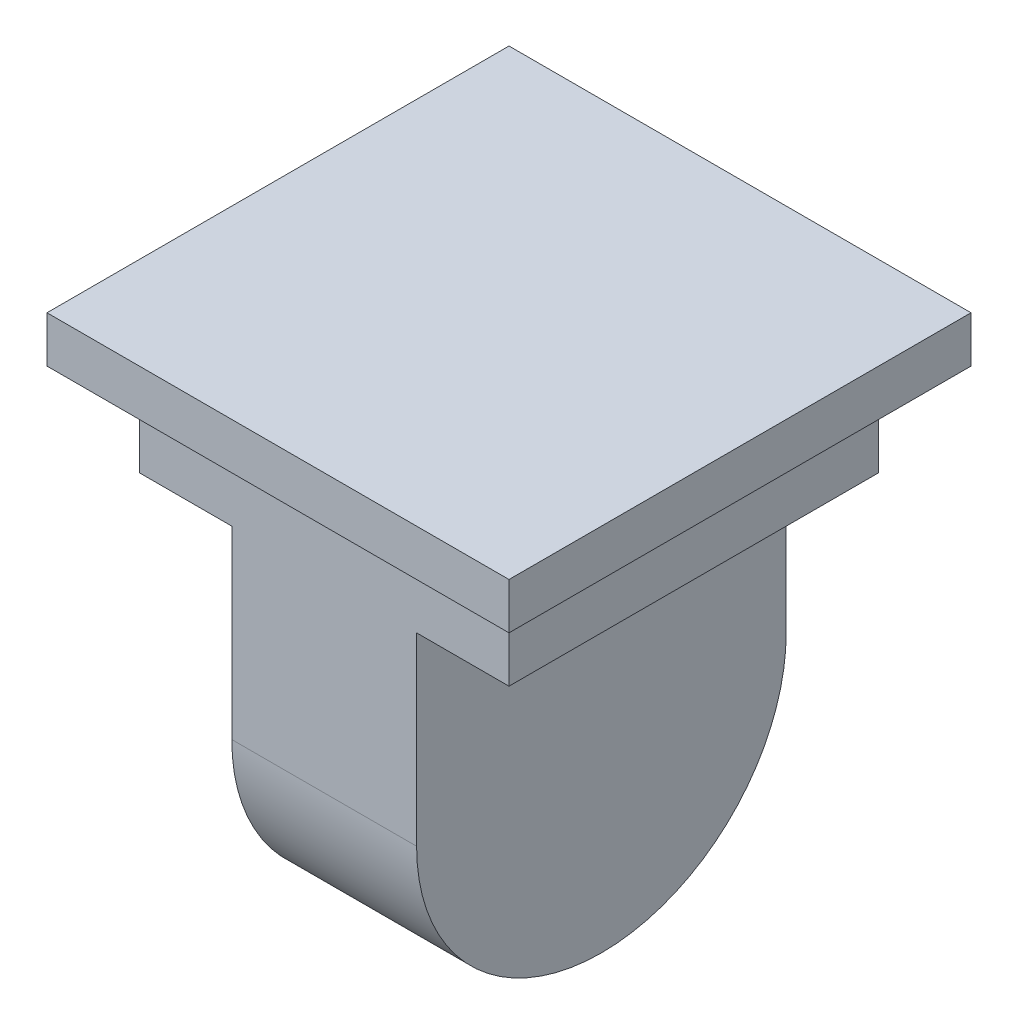
ISO-10303-21;
HEADER;
FILE_DESCRIPTION(('STEP AP214'),'2;1');
FILE_NAME('part.step','',(''),(''),'','','');
FILE_SCHEMA(('AUTOMOTIVE_DESIGN { 1 0 10303 214 1 1 1 1 }'));
ENDSEC;
DATA;
#1=APPLICATION_CONTEXT('core data for automotive mechanical design processes');
#2=APPLICATION_PROTOCOL_DEFINITION('international standard','automotive_design',2000,#1);
#3=PRODUCT_CONTEXT('',#1,'mechanical');
#4=PRODUCT('Part','Part','',(#3));
#5=PRODUCT_RELATED_PRODUCT_CATEGORY('part','',(#4));
#6=PRODUCT_DEFINITION_FORMATION('','',#4);
#7=PRODUCT_DEFINITION_CONTEXT('part definition',#1,'design');
#8=PRODUCT_DEFINITION('design','',#6,#7);
#9=PRODUCT_DEFINITION_SHAPE('','',#8);
#10=(LENGTH_UNIT() NAMED_UNIT(*) SI_UNIT(.MILLI.,.METRE.));
#11=(NAMED_UNIT(*) PLANE_ANGLE_UNIT() SI_UNIT($,.RADIAN.));
#12=(NAMED_UNIT(*) SI_UNIT($,.STERADIAN.) SOLID_ANGLE_UNIT());
#13=UNCERTAINTY_MEASURE_WITH_UNIT(LENGTH_MEASURE(1.E-05),#10,'distance_accuracy_value','');
#14=(GEOMETRIC_REPRESENTATION_CONTEXT(3) GLOBAL_UNCERTAINTY_ASSIGNED_CONTEXT((#13)) GLOBAL_UNIT_ASSIGNED_CONTEXT((#10,
#11,#12)) REPRESENTATION_CONTEXT('',''));
#15=CARTESIAN_POINT('',(0.,0.,0.));
#16=DIRECTION('',(0.,0.,1.));
#17=DIRECTION('',(1.,0.,0.));
#18=AXIS2_PLACEMENT_3D('',#15,#16,#17);
#19=CARTESIAN_POINT('',(-32.,8.,0.));
#20=DIRECTION('',(1.,0.,0.));
#21=DIRECTION('',(0.,0.,-1.));
#22=AXIS2_PLACEMENT_3D('',#19,#20,#21);
#23=CYLINDRICAL_SURFACE('',#22,8.);
#24=CARTESIAN_POINT('',(4.,8.,0.));
#25=DIRECTION('',(1.,0.,0.));
#26=DIRECTION('',(0.,0.,-1.));
#27=AXIS2_PLACEMENT_3D('',#24,#25,#26);
#28=CIRCLE('',#27,8.);
#29=CARTESIAN_POINT('',(4.,8.,8.));
#30=VERTEX_POINT('',#29);
#31=CARTESIAN_POINT('',(4.,8.,-8.));
#32=VERTEX_POINT('',#31);
#33=EDGE_CURVE('E51',#30,#32,#28,.T.);
#34=ORIENTED_EDGE('',*,*,#33,.F.);
#35=DIRECTION('',(1.,0.,0.));
#36=VECTOR('',#35,1.);
#37=CARTESIAN_POINT('',(-32.,8.,8.00000000000001));
#38=LINE('',#37,#36);
#39=CARTESIAN_POINT('',(-4.,8.,8.));
#40=VERTEX_POINT('',#39);
#41=EDGE_CURVE('E186',#40,#30,#38,.T.);
#42=ORIENTED_EDGE('',*,*,#41,.F.);
#43=CARTESIAN_POINT('',(-4.,8.,0.));
#44=DIRECTION('',(-1.,0.,0.));
#45=DIRECTION('',(0.,0.,1.));
#46=AXIS2_PLACEMENT_3D('',#43,#44,#45);
#47=CIRCLE('',#46,8.);
#48=CARTESIAN_POINT('',(-4.,8.,-8.));
#49=VERTEX_POINT('',#48);
#50=EDGE_CURVE('E173',#49,#40,#47,.T.);
#51=ORIENTED_EDGE('',*,*,#50,.F.);
#52=DIRECTION('',(1.,0.,0.));
#53=VECTOR('',#52,1.);
#54=CARTESIAN_POINT('',(-32.,8.,-7.99999999999999));
#55=LINE('',#54,#53);
#56=EDGE_CURVE('E188',#49,#32,#55,.T.);
#57=ORIENTED_EDGE('',*,*,#56,.T.);
#58=EDGE_LOOP('',(#34,#42,#51,#57));
#59=FACE_BOUND('',#58,.T.);
#60=ADVANCED_FACE('F36',(#59),#23,.T.);
#61=CARTESIAN_POINT('',(-8.,20.,8.));
#62=DIRECTION('',(0.,0.,-1.));
#63=DIRECTION('',(-1.,0.,0.));
#64=AXIS2_PLACEMENT_3D('',#61,#62,#63);
#65=PLANE('',#64);
#66=DIRECTION('',(0.,-1.,0.));
#67=VECTOR('',#66,1.);
#68=CARTESIAN_POINT('',(4.,8.,8.));
#69=LINE('',#68,#67);
#70=CARTESIAN_POINT('',(4.,16.,8.));
#71=VERTEX_POINT('',#70);
#72=EDGE_CURVE('E165',#71,#30,#69,.T.);
#73=ORIENTED_EDGE('',*,*,#72,.F.);
#74=DIRECTION('',(1.,0.,0.));
#75=VECTOR('',#74,1.);
#76=CARTESIAN_POINT('',(4.,16.,8.));
#77=LINE('',#76,#75);
#78=CARTESIAN_POINT('',(8.,16.,8.));
#79=VERTEX_POINT('',#78);
#80=EDGE_CURVE('E168',#71,#79,#77,.T.);
#81=ORIENTED_EDGE('',*,*,#80,.T.);
#82=DIRECTION('',(0.,-1.,0.));
#83=VECTOR('',#82,1.);
#84=CARTESIAN_POINT('',(8.,20.,8.));
#85=LINE('',#84,#83);
#86=CARTESIAN_POINT('',(8.,20.,8.));
#87=VERTEX_POINT('',#86);
#88=EDGE_CURVE('E44',#87,#79,#85,.T.);
#89=ORIENTED_EDGE('',*,*,#88,.F.);
#90=DIRECTION('',(1.,0.,0.));
#91=VECTOR('',#90,1.);
#92=CARTESIAN_POINT('',(-8.,20.,8.));
#93=LINE('',#92,#91);
#94=CARTESIAN_POINT('',(-8.,20.,8.));
#95=VERTEX_POINT('',#94);
#96=EDGE_CURVE('E196',#95,#87,#93,.T.);
#97=ORIENTED_EDGE('',*,*,#96,.F.);
#98=DIRECTION('',(0.,-1.,0.));
#99=VECTOR('',#98,1.);
#100=CARTESIAN_POINT('',(-8.,20.,8.));
#101=LINE('',#100,#99);
#102=CARTESIAN_POINT('',(-8.,16.,8.));
#103=VERTEX_POINT('',#102);
#104=EDGE_CURVE('E11',#95,#103,#101,.T.);
#105=ORIENTED_EDGE('',*,*,#104,.T.);
#106=DIRECTION('',(-1.,0.,0.));
#107=VECTOR('',#106,1.);
#108=CARTESIAN_POINT('',(-4.,16.,8.));
#109=LINE('',#108,#107);
#110=CARTESIAN_POINT('',(-4.,16.,8.));
#111=VERTEX_POINT('',#110);
#112=EDGE_CURVE('E181',#111,#103,#109,.T.);
#113=ORIENTED_EDGE('',*,*,#112,.F.);
#114=DIRECTION('',(0.,1.,0.));
#115=VECTOR('',#114,1.);
#116=CARTESIAN_POINT('',(-4.,8.,8.));
#117=LINE('',#116,#115);
#118=EDGE_CURVE('E175',#40,#111,#117,.T.);
#119=ORIENTED_EDGE('',*,*,#118,.F.);
#120=ORIENTED_EDGE('',*,*,#41,.T.);
#121=EDGE_LOOP('',(#73,#81,#89,#97,#105,#113,#119,#120));
#122=FACE_BOUND('',#121,.T.);
#123=ADVANCED_FACE('F217',(#122),#65,.F.);
#124=CARTESIAN_POINT('',(-8.,20.,-8.));
#125=DIRECTION('',(1.,0.,0.));
#126=DIRECTION('',(0.,0.,-1.));
#127=AXIS2_PLACEMENT_3D('',#124,#125,#126);
#128=PLANE('',#127);
#129=DIRECTION('',(0.,-1.,0.));
#130=VECTOR('',#129,1.);
#131=CARTESIAN_POINT('',(-8.,20.,-8.));
#132=LINE('',#131,#130);
#133=CARTESIAN_POINT('',(-8.,20.,-8.));
#134=VERTEX_POINT('',#133);
#135=CARTESIAN_POINT('',(-8.,16.,-8.));
#136=VERTEX_POINT('',#135);
#137=EDGE_CURVE('E205',#134,#136,#132,.T.);
#138=ORIENTED_EDGE('',*,*,#137,.T.);
#139=DIRECTION('',(0.,0.,-1.));
#140=VECTOR('',#139,1.);
#141=CARTESIAN_POINT('',(-8.,16.,-8.));
#142=LINE('',#141,#140);
#143=EDGE_CURVE('E171',#103,#136,#142,.T.);
#144=ORIENTED_EDGE('',*,*,#143,.F.);
#145=ORIENTED_EDGE('',*,*,#104,.F.);
#146=DIRECTION('',(0.,0.,1.));
#147=VECTOR('',#146,1.);
#148=CARTESIAN_POINT('',(-8.,20.,-8.));
#149=LINE('',#148,#147);
#150=EDGE_CURVE('E191',#134,#95,#149,.T.);
#151=ORIENTED_EDGE('',*,*,#150,.F.);
#152=EDGE_LOOP('',(#138,#144,#145,#151));
#153=FACE_BOUND('',#152,.T.);
#154=ADVANCED_FACE('F38',(#153),#128,.F.);
#155=CARTESIAN_POINT('',(8.,20.,-8.));
#156=DIRECTION('',(-1.,0.,0.));
#157=DIRECTION('',(0.,0.,1.));
#158=AXIS2_PLACEMENT_3D('',#155,#156,#157);
#159=PLANE('',#158);
#160=ORIENTED_EDGE('',*,*,#88,.T.);
#161=DIRECTION('',(0.,0.,1.));
#162=VECTOR('',#161,1.);
#163=CARTESIAN_POINT('',(8.,16.,8.));
#164=LINE('',#163,#162);
#165=CARTESIAN_POINT('',(8.,16.,-8.00000000000001));
#166=VERTEX_POINT('',#165);
#167=EDGE_CURVE('E152',#166,#79,#164,.T.);
#168=ORIENTED_EDGE('',*,*,#167,.F.);
#169=DIRECTION('',(0.,-1.,0.));
#170=VECTOR('',#169,1.);
#171=CARTESIAN_POINT('',(8.,20.,-8.));
#172=LINE('',#171,#170);
#173=CARTESIAN_POINT('',(8.,20.,-8.));
#174=VERTEX_POINT('',#173);
#175=EDGE_CURVE('E208',#174,#166,#172,.T.);
#176=ORIENTED_EDGE('',*,*,#175,.F.);
#177=DIRECTION('',(0.,0.,-1.));
#178=VECTOR('',#177,1.);
#179=CARTESIAN_POINT('',(8.,20.,-8.));
#180=LINE('',#179,#178);
#181=EDGE_CURVE('E199',#87,#174,#180,.T.);
#182=ORIENTED_EDGE('',*,*,#181,.F.);
#183=EDGE_LOOP('',(#160,#168,#176,#182));
#184=FACE_BOUND('',#183,.T.);
#185=ADVANCED_FACE('F214',(#184),#159,.F.);
#186=CARTESIAN_POINT('',(-8.,20.,-8.));
#187=DIRECTION('',(0.,0.,1.));
#188=DIRECTION('',(1.,0.,0.));
#189=AXIS2_PLACEMENT_3D('',#186,#187,#188);
#190=PLANE('',#189);
#191=ORIENTED_EDGE('',*,*,#175,.T.);
#192=DIRECTION('',(1.,0.,0.));
#193=VECTOR('',#192,1.);
#194=CARTESIAN_POINT('',(4.,16.,-8.00000000000001));
#195=LINE('',#194,#193);
#196=CARTESIAN_POINT('',(4.,16.,-8.00000000000001));
#197=VERTEX_POINT('',#196);
#198=EDGE_CURVE('E166',#197,#166,#195,.T.);
#199=ORIENTED_EDGE('',*,*,#198,.F.);
#200=DIRECTION('',(0.,1.,0.));
#201=VECTOR('',#200,1.);
#202=CARTESIAN_POINT('',(4.,8.,-8.00000000000001));
#203=LINE('',#202,#201);
#204=EDGE_CURVE('E160',#32,#197,#203,.T.);
#205=ORIENTED_EDGE('',*,*,#204,.F.);
#206=ORIENTED_EDGE('',*,*,#56,.F.);
#207=DIRECTION('',(0.,-1.,0.));
#208=VECTOR('',#207,1.);
#209=CARTESIAN_POINT('',(-4.,8.,-8.));
#210=LINE('',#209,#208);
#211=CARTESIAN_POINT('',(-4.,16.,-8.));
#212=VERTEX_POINT('',#211);
#213=EDGE_CURVE('E59',#212,#49,#210,.T.);
#214=ORIENTED_EDGE('',*,*,#213,.F.);
#215=DIRECTION('',(-1.,0.,0.));
#216=VECTOR('',#215,1.);
#217=CARTESIAN_POINT('',(-4.,16.,-8.));
#218=LINE('',#217,#216);
#219=EDGE_CURVE('E183',#212,#136,#218,.T.);
#220=ORIENTED_EDGE('',*,*,#219,.T.);
#221=ORIENTED_EDGE('',*,*,#137,.F.);
#222=DIRECTION('',(-1.,0.,0.));
#223=VECTOR('',#222,1.);
#224=CARTESIAN_POINT('',(-8.,20.,-8.));
#225=LINE('',#224,#223);
#226=EDGE_CURVE('E202',#174,#134,#225,.T.);
#227=ORIENTED_EDGE('',*,*,#226,.F.);
#228=EDGE_LOOP('',(#191,#199,#205,#206,#214,#220,#221,#227));
#229=FACE_BOUND('',#228,.T.);
#230=ADVANCED_FACE('F225',(#229),#190,.F.);
#231=CARTESIAN_POINT('',(-4.,16.,-8.));
#232=DIRECTION('',(0.,1.,0.));
#233=DIRECTION('',(0.,0.,1.));
#234=AXIS2_PLACEMENT_3D('',#231,#232,#233);
#235=PLANE('',#234);
#236=ORIENTED_EDGE('',*,*,#143,.T.);
#237=ORIENTED_EDGE('',*,*,#219,.F.);
#238=DIRECTION('',(0.,0.,-1.));
#239=VECTOR('',#238,1.);
#240=CARTESIAN_POINT('',(-4.,16.,-8.));
#241=LINE('',#240,#239);
#242=EDGE_CURVE('E178',#111,#212,#241,.T.);
#243=ORIENTED_EDGE('',*,*,#242,.F.);
#244=ORIENTED_EDGE('',*,*,#112,.T.);
#245=EDGE_LOOP('',(#236,#237,#243,#244));
#246=FACE_BOUND('',#245,.T.);
#247=ADVANCED_FACE('F236',(#246),#235,.F.);
#248=CARTESIAN_POINT('',(-4.,8.,0.));
#249=DIRECTION('',(-1.,0.,0.));
#250=DIRECTION('',(0.,0.,1.));
#251=AXIS2_PLACEMENT_3D('',#248,#249,#250);
#252=PLANE('',#251);
#253=ORIENTED_EDGE('',*,*,#50,.T.);
#254=ORIENTED_EDGE('',*,*,#118,.T.);
#255=ORIENTED_EDGE('',*,*,#242,.T.);
#256=ORIENTED_EDGE('',*,*,#213,.T.);
#257=EDGE_LOOP('',(#253,#254,#255,#256));
#258=FACE_BOUND('',#257,.T.);
#259=ADVANCED_FACE('F237',(#258),#252,.T.);
#260=CARTESIAN_POINT('',(4.,16.,8.));
#261=DIRECTION('',(0.,1.,0.));
#262=DIRECTION('',(0.,0.,1.));
#263=AXIS2_PLACEMENT_3D('',#260,#261,#262);
#264=PLANE('',#263);
#265=ORIENTED_EDGE('',*,*,#167,.T.);
#266=ORIENTED_EDGE('',*,*,#80,.F.);
#267=DIRECTION('',(0.,0.,1.));
#268=VECTOR('',#267,1.);
#269=CARTESIAN_POINT('',(4.,16.,8.));
#270=LINE('',#269,#268);
#271=EDGE_CURVE('E162',#197,#71,#270,.T.);
#272=ORIENTED_EDGE('',*,*,#271,.F.);
#273=ORIENTED_EDGE('',*,*,#198,.T.);
#274=EDGE_LOOP('',(#265,#266,#272,#273));
#275=FACE_BOUND('',#274,.T.);
#276=ADVANCED_FACE('F220',(#275),#264,.F.);
#277=CARTESIAN_POINT('',(4.,8.,0.));
#278=DIRECTION('',(1.,0.,0.));
#279=DIRECTION('',(0.,0.,-1.));
#280=AXIS2_PLACEMENT_3D('',#277,#278,#279);
#281=PLANE('',#280);
#282=ORIENTED_EDGE('',*,*,#33,.T.);
#283=ORIENTED_EDGE('',*,*,#204,.T.);
#284=ORIENTED_EDGE('',*,*,#271,.T.);
#285=ORIENTED_EDGE('',*,*,#72,.T.);
#286=EDGE_LOOP('',(#282,#283,#284,#285));
#287=FACE_BOUND('',#286,.T.);
#288=ADVANCED_FACE('F221',(#287),#281,.T.);
#289=CARTESIAN_POINT('',(0.,20.,0.));
#290=DIRECTION('',(0.,1.,0.));
#291=DIRECTION('',(0.,0.,1.));
#292=AXIS2_PLACEMENT_3D('',#289,#290,#291);
#293=PLANE('',#292);
#294=DIRECTION('',(0.,0.,1.));
#295=VECTOR('',#294,1.);
#296=CARTESIAN_POINT('',(-10.,20.,-10.));
#297=LINE('',#296,#295);
#298=CARTESIAN_POINT('',(-10.,20.,-10.));
#299=VERTEX_POINT('',#298);
#300=CARTESIAN_POINT('',(-10.,20.,10.));
#301=VERTEX_POINT('',#300);
#302=EDGE_CURVE('E151',#299,#301,#297,.T.);
#303=ORIENTED_EDGE('',*,*,#302,.F.);
#304=DIRECTION('',(-1.,0.,0.));
#305=VECTOR('',#304,1.);
#306=CARTESIAN_POINT('',(-10.,20.,-10.));
#307=LINE('',#306,#305);
#308=CARTESIAN_POINT('',(10.,20.,-10.));
#309=VERTEX_POINT('',#308);
#310=EDGE_CURVE('E147',#309,#299,#307,.T.);
#311=ORIENTED_EDGE('',*,*,#310,.F.);
#312=DIRECTION('',(0.,0.,-1.));
#313=VECTOR('',#312,1.);
#314=CARTESIAN_POINT('',(10.,20.,-10.));
#315=LINE('',#314,#313);
#316=CARTESIAN_POINT('',(10.,20.,10.));
#317=VERTEX_POINT('',#316);
#318=EDGE_CURVE('E363',#317,#309,#315,.T.);
#319=ORIENTED_EDGE('',*,*,#318,.F.);
#320=DIRECTION('',(1.,0.,0.));
#321=VECTOR('',#320,1.);
#322=CARTESIAN_POINT('',(-10.,20.,10.));
#323=LINE('',#322,#321);
#324=EDGE_CURVE('E366',#301,#317,#323,.T.);
#325=ORIENTED_EDGE('',*,*,#324,.F.);
#326=EDGE_LOOP('',(#303,#311,#319,#325));
#327=FACE_BOUND('',#326,.T.);
#328=ORIENTED_EDGE('',*,*,#226,.T.);
#329=ORIENTED_EDGE('',*,*,#150,.T.);
#330=ORIENTED_EDGE('',*,*,#96,.T.);
#331=ORIENTED_EDGE('',*,*,#181,.T.);
#332=EDGE_LOOP('',(#328,#329,#330,#331));
#333=FACE_BOUND('',#332,.T.);
#334=ADVANCED_FACE('F229',(#327,#333),#293,.F.);
#335=CARTESIAN_POINT('',(-10.,22.,-10.));
#336=DIRECTION('',(1.,0.,0.));
#337=DIRECTION('',(0.,0.,-1.));
#338=AXIS2_PLACEMENT_3D('',#335,#336,#337);
#339=PLANE('',#338);
#340=ORIENTED_EDGE('',*,*,#302,.T.);
#341=DIRECTION('',(0.,-1.,0.));
#342=VECTOR('',#341,1.);
#343=CARTESIAN_POINT('',(-10.,22.,10.));
#344=LINE('',#343,#342);
#345=CARTESIAN_POINT('',(-10.,22.,10.));
#346=VERTEX_POINT('',#345);
#347=EDGE_CURVE('E131',#346,#301,#344,.T.);
#348=ORIENTED_EDGE('',*,*,#347,.F.);
#349=DIRECTION('',(0.,0.,1.));
#350=VECTOR('',#349,1.);
#351=CARTESIAN_POINT('',(-10.,22.,-10.));
#352=LINE('',#351,#350);
#353=CARTESIAN_POINT('',(-10.,22.,-10.));
#354=VERTEX_POINT('',#353);
#355=EDGE_CURVE('E138',#354,#346,#352,.T.);
#356=ORIENTED_EDGE('',*,*,#355,.F.);
#357=DIRECTION('',(0.,-1.,0.));
#358=VECTOR('',#357,1.);
#359=CARTESIAN_POINT('',(-10.,22.,-10.));
#360=LINE('',#359,#358);
#361=EDGE_CURVE('E360',#354,#299,#360,.T.);
#362=ORIENTED_EDGE('',*,*,#361,.T.);
#363=EDGE_LOOP('',(#340,#348,#356,#362));
#364=FACE_BOUND('',#363,.T.);
#365=ADVANCED_FACE('F149',(#364),#339,.F.);
#366=CARTESIAN_POINT('',(-10.,22.,10.));
#367=DIRECTION('',(0.,0.,-1.));
#368=DIRECTION('',(-1.,0.,0.));
#369=AXIS2_PLACEMENT_3D('',#366,#367,#368);
#370=PLANE('',#369);
#371=ORIENTED_EDGE('',*,*,#324,.T.);
#372=DIRECTION('',(0.,-1.,0.));
#373=VECTOR('',#372,1.);
#374=CARTESIAN_POINT('',(10.,22.,10.));
#375=LINE('',#374,#373);
#376=CARTESIAN_POINT('',(10.,22.,10.));
#377=VERTEX_POINT('',#376);
#378=EDGE_CURVE('E134',#377,#317,#375,.T.);
#379=ORIENTED_EDGE('',*,*,#378,.F.);
#380=DIRECTION('',(1.,0.,0.));
#381=VECTOR('',#380,1.);
#382=CARTESIAN_POINT('',(-10.,22.,10.));
#383=LINE('',#382,#381);
#384=EDGE_CURVE('E127',#346,#377,#383,.T.);
#385=ORIENTED_EDGE('',*,*,#384,.F.);
#386=ORIENTED_EDGE('',*,*,#347,.T.);
#387=EDGE_LOOP('',(#371,#379,#385,#386));
#388=FACE_BOUND('',#387,.T.);
#389=ADVANCED_FACE('F129',(#388),#370,.F.);
#390=CARTESIAN_POINT('',(10.,22.,-10.));
#391=DIRECTION('',(-1.,0.,0.));
#392=DIRECTION('',(0.,0.,1.));
#393=AXIS2_PLACEMENT_3D('',#390,#391,#392);
#394=PLANE('',#393);
#395=ORIENTED_EDGE('',*,*,#318,.T.);
#396=DIRECTION('',(0.,-1.,0.));
#397=VECTOR('',#396,1.);
#398=CARTESIAN_POINT('',(10.,22.,-10.));
#399=LINE('',#398,#397);
#400=CARTESIAN_POINT('',(10.,22.,-10.));
#401=VERTEX_POINT('',#400);
#402=EDGE_CURVE('E155',#401,#309,#399,.T.);
#403=ORIENTED_EDGE('',*,*,#402,.F.);
#404=DIRECTION('',(0.,0.,-1.));
#405=VECTOR('',#404,1.);
#406=CARTESIAN_POINT('',(10.,22.,-10.));
#407=LINE('',#406,#405);
#408=EDGE_CURVE('E137',#377,#401,#407,.T.);
#409=ORIENTED_EDGE('',*,*,#408,.F.);
#410=ORIENTED_EDGE('',*,*,#378,.T.);
#411=EDGE_LOOP('',(#395,#403,#409,#410));
#412=FACE_BOUND('',#411,.T.);
#413=ADVANCED_FACE('F327',(#412),#394,.F.);
#414=CARTESIAN_POINT('',(-10.,22.,-10.));
#415=DIRECTION('',(0.,0.,1.));
#416=DIRECTION('',(1.,0.,0.));
#417=AXIS2_PLACEMENT_3D('',#414,#415,#416);
#418=PLANE('',#417);
#419=ORIENTED_EDGE('',*,*,#310,.T.);
#420=ORIENTED_EDGE('',*,*,#361,.F.);
#421=DIRECTION('',(-1.,0.,0.));
#422=VECTOR('',#421,1.);
#423=CARTESIAN_POINT('',(-10.,22.,-10.));
#424=LINE('',#423,#422);
#425=EDGE_CURVE('E143',#401,#354,#424,.T.);
#426=ORIENTED_EDGE('',*,*,#425,.F.);
#427=ORIENTED_EDGE('',*,*,#402,.T.);
#428=EDGE_LOOP('',(#419,#420,#426,#427));
#429=FACE_BOUND('',#428,.T.);
#430=ADVANCED_FACE('F336',(#429),#418,.F.);
#431=CARTESIAN_POINT('',(0.,22.,0.));
#432=DIRECTION('',(0.,1.,0.));
#433=DIRECTION('',(0.,0.,1.));
#434=AXIS2_PLACEMENT_3D('',#431,#432,#433);
#435=PLANE('',#434);
#436=ORIENTED_EDGE('',*,*,#355,.T.);
#437=ORIENTED_EDGE('',*,*,#384,.T.);
#438=ORIENTED_EDGE('',*,*,#408,.T.);
#439=ORIENTED_EDGE('',*,*,#425,.T.);
#440=EDGE_LOOP('',(#436,#437,#438,#439));
#441=FACE_BOUND('',#440,.T.);
#442=ADVANCED_FACE('F141',(#441),#435,.T.);
#443=CLOSED_SHELL('',(#60,#123,#154,#185,#230,#247,#259,#276,#288,#334,#365,#389,#413,#430,#442));
#444=MANIFOLD_SOLID_BREP('B2',#443);
#445=ADVANCED_BREP_SHAPE_REPRESENTATION('',(#18,#444),#14);
#446=SHAPE_DEFINITION_REPRESENTATION(#9,#445);
ENDSEC;
END-ISO-10303-21;
